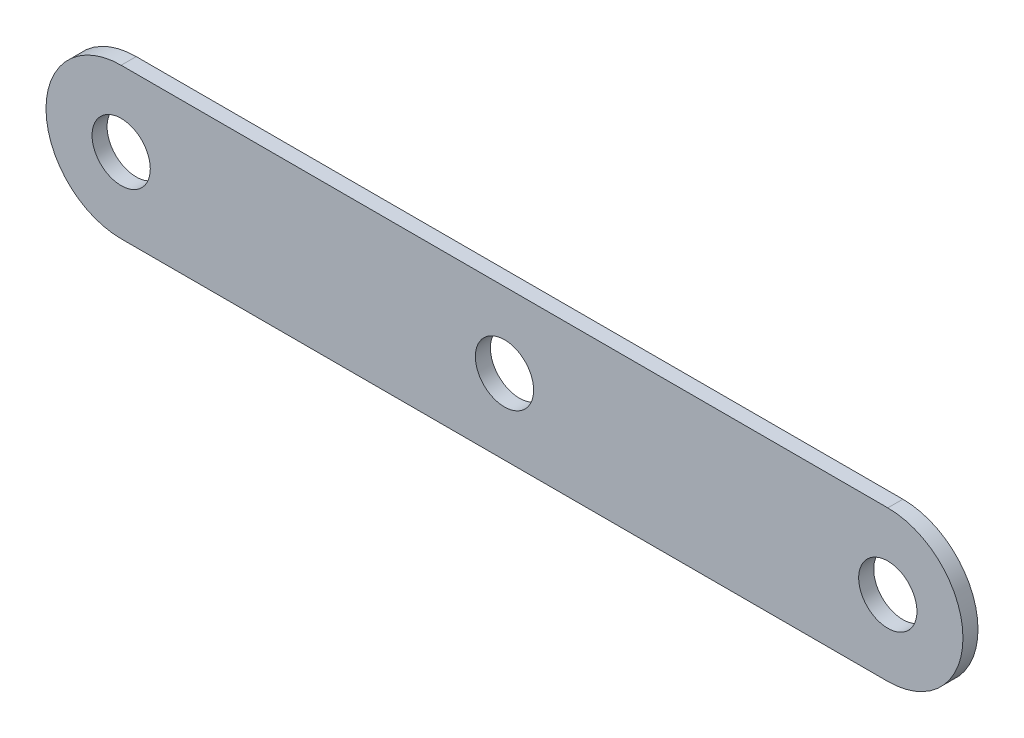
ISO-10303-21;
HEADER;
FILE_DESCRIPTION(('STEP AP214'),'2;1');
FILE_NAME('part.step','',(''),(''),'','','');
FILE_SCHEMA(('AUTOMOTIVE_DESIGN { 1 0 10303 214 1 1 1 1 }'));
ENDSEC;
DATA;
#1=APPLICATION_CONTEXT('core data for automotive mechanical design processes');
#2=APPLICATION_PROTOCOL_DEFINITION('international standard','automotive_design',2000,#1);
#3=PRODUCT_CONTEXT('',#1,'mechanical');
#4=PRODUCT('Part','Part','',(#3));
#5=PRODUCT_RELATED_PRODUCT_CATEGORY('part','',(#4));
#6=PRODUCT_DEFINITION_FORMATION('','',#4);
#7=PRODUCT_DEFINITION_CONTEXT('part definition',#1,'design');
#8=PRODUCT_DEFINITION('design','',#6,#7);
#9=PRODUCT_DEFINITION_SHAPE('','',#8);
#10=(LENGTH_UNIT() NAMED_UNIT(*) SI_UNIT(.MILLI.,.METRE.));
#11=(NAMED_UNIT(*) PLANE_ANGLE_UNIT() SI_UNIT($,.RADIAN.));
#12=(NAMED_UNIT(*) SI_UNIT($,.STERADIAN.) SOLID_ANGLE_UNIT());
#13=UNCERTAINTY_MEASURE_WITH_UNIT(LENGTH_MEASURE(1.E-05),#10,'distance_accuracy_value','');
#14=(GEOMETRIC_REPRESENTATION_CONTEXT(3) GLOBAL_UNCERTAINTY_ASSIGNED_CONTEXT((#13)) GLOBAL_UNIT_ASSIGNED_CONTEXT((#10,
#11,#12)) REPRESENTATION_CONTEXT('',''));
#15=CARTESIAN_POINT('',(0.,0.,0.));
#16=DIRECTION('',(0.,0.,1.));
#17=DIRECTION('',(1.,0.,0.));
#18=AXIS2_PLACEMENT_3D('',#15,#16,#17);
#19=CARTESIAN_POINT('',(0.,0.,4.));
#20=DIRECTION('',(0.,0.,-1.));
#21=DIRECTION('',(-1.,0.,0.));
#22=AXIS2_PLACEMENT_3D('',#19,#20,#21);
#23=CYLINDRICAL_SURFACE('',#22,20.);
#24=CARTESIAN_POINT('',(0.,0.,0.));
#25=DIRECTION('',(0.,0.,1.));
#26=DIRECTION('',(1.,0.,0.));
#27=AXIS2_PLACEMENT_3D('',#24,#25,#26);
#28=CIRCLE('',#27,20.);
#29=CARTESIAN_POINT('',(0.,20.,0.));
#30=VERTEX_POINT('',#29);
#31=CARTESIAN_POINT('',(0.,-20.,0.));
#32=VERTEX_POINT('',#31);
#33=EDGE_CURVE('E96',#30,#32,#28,.T.);
#34=ORIENTED_EDGE('',*,*,#33,.T.);
#35=DIRECTION('',(0.,0.,-1.));
#36=VECTOR('',#35,1.);
#37=CARTESIAN_POINT('',(0.,-20.,4.));
#38=LINE('',#37,#36);
#39=CARTESIAN_POINT('',(0.,-20.,4.));
#40=VERTEX_POINT('',#39);
#41=EDGE_CURVE('E11',#40,#32,#38,.T.);
#42=ORIENTED_EDGE('',*,*,#41,.F.);
#43=CARTESIAN_POINT('',(0.,0.,4.));
#44=DIRECTION('',(0.,0.,1.));
#45=DIRECTION('',(1.,0.,0.));
#46=AXIS2_PLACEMENT_3D('',#43,#44,#45);
#47=CIRCLE('',#46,20.);
#48=CARTESIAN_POINT('',(0.,20.,4.));
#49=VERTEX_POINT('',#48);
#50=EDGE_CURVE('E84',#49,#40,#47,.T.);
#51=ORIENTED_EDGE('',*,*,#50,.F.);
#52=DIRECTION('',(0.,0.,-1.));
#53=VECTOR('',#52,1.);
#54=CARTESIAN_POINT('',(0.,20.,4.));
#55=LINE('',#54,#53);
#56=EDGE_CURVE('E92',#49,#30,#55,.T.);
#57=ORIENTED_EDGE('',*,*,#56,.T.);
#58=EDGE_LOOP('',(#34,#42,#51,#57));
#59=FACE_BOUND('',#58,.T.);
#60=ADVANCED_FACE('F33',(#59),#23,.T.);
#61=CARTESIAN_POINT('',(0.,-20.,4.));
#62=DIRECTION('',(0.,1.,0.));
#63=DIRECTION('',(0.,0.,1.));
#64=AXIS2_PLACEMENT_3D('',#61,#62,#63);
#65=PLANE('',#64);
#66=DIRECTION('',(1.,0.,0.));
#67=VECTOR('',#66,1.);
#68=CARTESIAN_POINT('',(0.,-20.,0.));
#69=LINE('',#68,#67);
#70=CARTESIAN_POINT('',(204.,-20.,0.));
#71=VERTEX_POINT('',#70);
#72=EDGE_CURVE('E88',#32,#71,#69,.T.);
#73=ORIENTED_EDGE('',*,*,#72,.T.);
#74=DIRECTION('',(0.,0.,-1.));
#75=VECTOR('',#74,1.);
#76=CARTESIAN_POINT('',(204.,-20.,4.));
#77=LINE('',#76,#75);
#78=CARTESIAN_POINT('',(204.,-20.,4.));
#79=VERTEX_POINT('',#78);
#80=EDGE_CURVE('E41',#79,#71,#77,.T.);
#81=ORIENTED_EDGE('',*,*,#80,.F.);
#82=DIRECTION('',(1.,0.,0.));
#83=VECTOR('',#82,1.);
#84=CARTESIAN_POINT('',(0.,-20.,4.));
#85=LINE('',#84,#83);
#86=EDGE_CURVE('E79',#40,#79,#85,.T.);
#87=ORIENTED_EDGE('',*,*,#86,.F.);
#88=ORIENTED_EDGE('',*,*,#41,.T.);
#89=EDGE_LOOP('',(#73,#81,#87,#88));
#90=FACE_BOUND('',#89,.T.);
#91=ADVANCED_FACE('F87',(#90),#65,.F.);
#92=CARTESIAN_POINT('',(204.,0.,4.));
#93=DIRECTION('',(0.,0.,-1.));
#94=DIRECTION('',(-1.,0.,0.));
#95=AXIS2_PLACEMENT_3D('',#92,#93,#94);
#96=CYLINDRICAL_SURFACE('',#95,20.);
#97=CARTESIAN_POINT('',(204.,0.,0.));
#98=DIRECTION('',(0.,0.,1.));
#99=DIRECTION('',(1.,0.,0.));
#100=AXIS2_PLACEMENT_3D('',#97,#98,#99);
#101=CIRCLE('',#100,20.);
#102=CARTESIAN_POINT('',(204.,20.,0.));
#103=VERTEX_POINT('',#102);
#104=EDGE_CURVE('E66',#71,#103,#101,.T.);
#105=ORIENTED_EDGE('',*,*,#104,.T.);
#106=DIRECTION('',(0.,0.,-1.));
#107=VECTOR('',#106,1.);
#108=CARTESIAN_POINT('',(204.,20.,4.));
#109=LINE('',#108,#107);
#110=CARTESIAN_POINT('',(204.,20.,4.));
#111=VERTEX_POINT('',#110);
#112=EDGE_CURVE('E89',#111,#103,#109,.T.);
#113=ORIENTED_EDGE('',*,*,#112,.F.);
#114=CARTESIAN_POINT('',(204.,0.,4.));
#115=DIRECTION('',(0.,0.,1.));
#116=DIRECTION('',(1.,0.,0.));
#117=AXIS2_PLACEMENT_3D('',#114,#115,#116);
#118=CIRCLE('',#117,20.);
#119=EDGE_CURVE('E82',#79,#111,#118,.T.);
#120=ORIENTED_EDGE('',*,*,#119,.F.);
#121=ORIENTED_EDGE('',*,*,#80,.T.);
#122=EDGE_LOOP('',(#105,#113,#120,#121));
#123=FACE_BOUND('',#122,.T.);
#124=ADVANCED_FACE('F90',(#123),#96,.T.);
#125=CARTESIAN_POINT('',(0.,20.,4.));
#126=DIRECTION('',(0.,-1.,0.));
#127=DIRECTION('',(0.,0.,-1.));
#128=AXIS2_PLACEMENT_3D('',#125,#126,#127);
#129=PLANE('',#128);
#130=DIRECTION('',(-1.,0.,0.));
#131=VECTOR('',#130,1.);
#132=CARTESIAN_POINT('',(0.,20.,0.));
#133=LINE('',#132,#131);
#134=EDGE_CURVE('E72',#103,#30,#133,.T.);
#135=ORIENTED_EDGE('',*,*,#134,.T.);
#136=ORIENTED_EDGE('',*,*,#56,.F.);
#137=DIRECTION('',(-1.,0.,0.));
#138=VECTOR('',#137,1.);
#139=CARTESIAN_POINT('',(0.,20.,4.));
#140=LINE('',#139,#138);
#141=EDGE_CURVE('E49',#111,#49,#140,.T.);
#142=ORIENTED_EDGE('',*,*,#141,.F.);
#143=ORIENTED_EDGE('',*,*,#112,.T.);
#144=EDGE_LOOP('',(#135,#136,#142,#143));
#145=FACE_BOUND('',#144,.T.);
#146=ADVANCED_FACE('F104',(#145),#129,.F.);
#147=CARTESIAN_POINT('',(0.,0.,4.));
#148=DIRECTION('',(0.,0.,1.));
#149=DIRECTION('',(1.,0.,0.));
#150=AXIS2_PLACEMENT_3D('',#147,#148,#149);
#151=PLANE('',#150);
#152=CARTESIAN_POINT('',(102.,0.,4.));
#153=DIRECTION('',(0.,0.,1.));
#154=DIRECTION('',(1.,0.,0.));
#155=AXIS2_PLACEMENT_3D('',#152,#153,#154);
#156=CIRCLE('',#155,7.75);
#157=CARTESIAN_POINT('',(109.75,0.,4.));
#158=VERTEX_POINT('',#157);
#159=EDGE_CURVE('E124',#158,#158,#156,.T.);
#160=ORIENTED_EDGE('',*,*,#159,.F.);
#161=EDGE_LOOP('',(#160));
#162=FACE_BOUND('',#161,.T.);
#163=CARTESIAN_POINT('',(0.,0.,4.));
#164=DIRECTION('',(0.,0.,1.));
#165=DIRECTION('',(1.,0.,0.));
#166=AXIS2_PLACEMENT_3D('',#163,#164,#165);
#167=CIRCLE('',#166,7.75);
#168=CARTESIAN_POINT('',(7.75,0.,4.));
#169=VERTEX_POINT('',#168);
#170=EDGE_CURVE('E113',#169,#169,#167,.T.);
#171=ORIENTED_EDGE('',*,*,#170,.F.);
#172=EDGE_LOOP('',(#171));
#173=FACE_BOUND('',#172,.T.);
#174=CARTESIAN_POINT('',(204.,0.,4.));
#175=DIRECTION('',(0.,0.,1.));
#176=DIRECTION('',(1.,0.,0.));
#177=AXIS2_PLACEMENT_3D('',#174,#175,#176);
#178=CIRCLE('',#177,7.75);
#179=CARTESIAN_POINT('',(211.75,0.,4.));
#180=VERTEX_POINT('',#179);
#181=EDGE_CURVE('E114',#180,#180,#178,.T.);
#182=ORIENTED_EDGE('',*,*,#181,.F.);
#183=EDGE_LOOP('',(#182));
#184=FACE_BOUND('',#183,.T.);
#185=ORIENTED_EDGE('',*,*,#50,.T.);
#186=ORIENTED_EDGE('',*,*,#86,.T.);
#187=ORIENTED_EDGE('',*,*,#119,.T.);
#188=ORIENTED_EDGE('',*,*,#141,.T.);
#189=EDGE_LOOP('',(#185,#186,#187,#188));
#190=FACE_BOUND('',#189,.T.);
#191=ADVANCED_FACE('F80',(#162,#173,#184,#190),#151,.T.);
#192=CARTESIAN_POINT('',(0.,0.,0.));
#193=DIRECTION('',(0.,0.,1.));
#194=DIRECTION('',(1.,0.,0.));
#195=AXIS2_PLACEMENT_3D('',#192,#193,#194);
#196=PLANE('',#195);
#197=CARTESIAN_POINT('',(102.,0.,0.));
#198=DIRECTION('',(0.,0.,1.));
#199=DIRECTION('',(1.,0.,0.));
#200=AXIS2_PLACEMENT_3D('',#197,#198,#199);
#201=CIRCLE('',#200,7.75);
#202=CARTESIAN_POINT('',(109.75,0.,0.));
#203=VERTEX_POINT('',#202);
#204=EDGE_CURVE('E117',#203,#203,#201,.F.);
#205=ORIENTED_EDGE('',*,*,#204,.F.);
#206=EDGE_LOOP('',(#205));
#207=FACE_BOUND('',#206,.T.);
#208=CARTESIAN_POINT('',(0.,0.,0.));
#209=DIRECTION('',(0.,0.,1.));
#210=DIRECTION('',(1.,0.,0.));
#211=AXIS2_PLACEMENT_3D('',#208,#209,#210);
#212=CIRCLE('',#211,7.75);
#213=CARTESIAN_POINT('',(7.75,0.,0.));
#214=VERTEX_POINT('',#213);
#215=EDGE_CURVE('E99',#214,#214,#212,.F.);
#216=ORIENTED_EDGE('',*,*,#215,.F.);
#217=EDGE_LOOP('',(#216));
#218=FACE_BOUND('',#217,.T.);
#219=CARTESIAN_POINT('',(204.,0.,0.));
#220=DIRECTION('',(0.,0.,1.));
#221=DIRECTION('',(1.,0.,0.));
#222=AXIS2_PLACEMENT_3D('',#219,#220,#221);
#223=CIRCLE('',#222,7.75);
#224=CARTESIAN_POINT('',(211.75,0.,0.));
#225=VERTEX_POINT('',#224);
#226=EDGE_CURVE('E110',#225,#225,#223,.F.);
#227=ORIENTED_EDGE('',*,*,#226,.F.);
#228=EDGE_LOOP('',(#227));
#229=FACE_BOUND('',#228,.T.);
#230=ORIENTED_EDGE('',*,*,#33,.F.);
#231=ORIENTED_EDGE('',*,*,#134,.F.);
#232=ORIENTED_EDGE('',*,*,#104,.F.);
#233=ORIENTED_EDGE('',*,*,#72,.F.);
#234=EDGE_LOOP('',(#230,#231,#232,#233));
#235=FACE_BOUND('',#234,.T.);
#236=ADVANCED_FACE('F107',(#207,#218,#229,#235),#196,.F.);
#237=CARTESIAN_POINT('',(204.,0.,-0.00100000000000013));
#238=DIRECTION('',(0.,0.,1.));
#239=DIRECTION('',(1.,0.,0.));
#240=AXIS2_PLACEMENT_3D('',#237,#238,#239);
#241=CYLINDRICAL_SURFACE('',#240,7.75);
#242=ORIENTED_EDGE('',*,*,#181,.T.);
#243=EDGE_LOOP('',(#242));
#244=FACE_BOUND('',#243,.T.);
#245=ORIENTED_EDGE('',*,*,#226,.T.);
#246=EDGE_LOOP('',(#245));
#247=FACE_BOUND('',#246,.T.);
#248=ADVANCED_FACE('F138',(#244,#247),#241,.F.);
#249=CARTESIAN_POINT('',(0.,0.,-0.00100000000000013));
#250=DIRECTION('',(0.,0.,1.));
#251=DIRECTION('',(1.,0.,0.));
#252=AXIS2_PLACEMENT_3D('',#249,#250,#251);
#253=CYLINDRICAL_SURFACE('',#252,7.75);
#254=ORIENTED_EDGE('',*,*,#170,.T.);
#255=EDGE_LOOP('',(#254));
#256=FACE_BOUND('',#255,.T.);
#257=ORIENTED_EDGE('',*,*,#215,.T.);
#258=EDGE_LOOP('',(#257));
#259=FACE_BOUND('',#258,.T.);
#260=ADVANCED_FACE('F141',(#256,#259),#253,.F.);
#261=CARTESIAN_POINT('',(102.,0.,-0.00100000000000013));
#262=DIRECTION('',(0.,0.,1.));
#263=DIRECTION('',(1.,0.,0.));
#264=AXIS2_PLACEMENT_3D('',#261,#262,#263);
#265=CYLINDRICAL_SURFACE('',#264,7.75);
#266=ORIENTED_EDGE('',*,*,#159,.T.);
#267=EDGE_LOOP('',(#266));
#268=FACE_BOUND('',#267,.T.);
#269=ORIENTED_EDGE('',*,*,#204,.T.);
#270=EDGE_LOOP('',(#269));
#271=FACE_BOUND('',#270,.T.);
#272=ADVANCED_FACE('F128',(#268,#271),#265,.F.);
#273=CLOSED_SHELL('',(#60,#91,#124,#146,#191,#236,#248,#260,#272));
#274=MANIFOLD_SOLID_BREP('B2',#273);
#275=ADVANCED_BREP_SHAPE_REPRESENTATION('',(#18,#274),#14);
#276=SHAPE_DEFINITION_REPRESENTATION(#9,#275);
ENDSEC;
END-ISO-10303-21;
